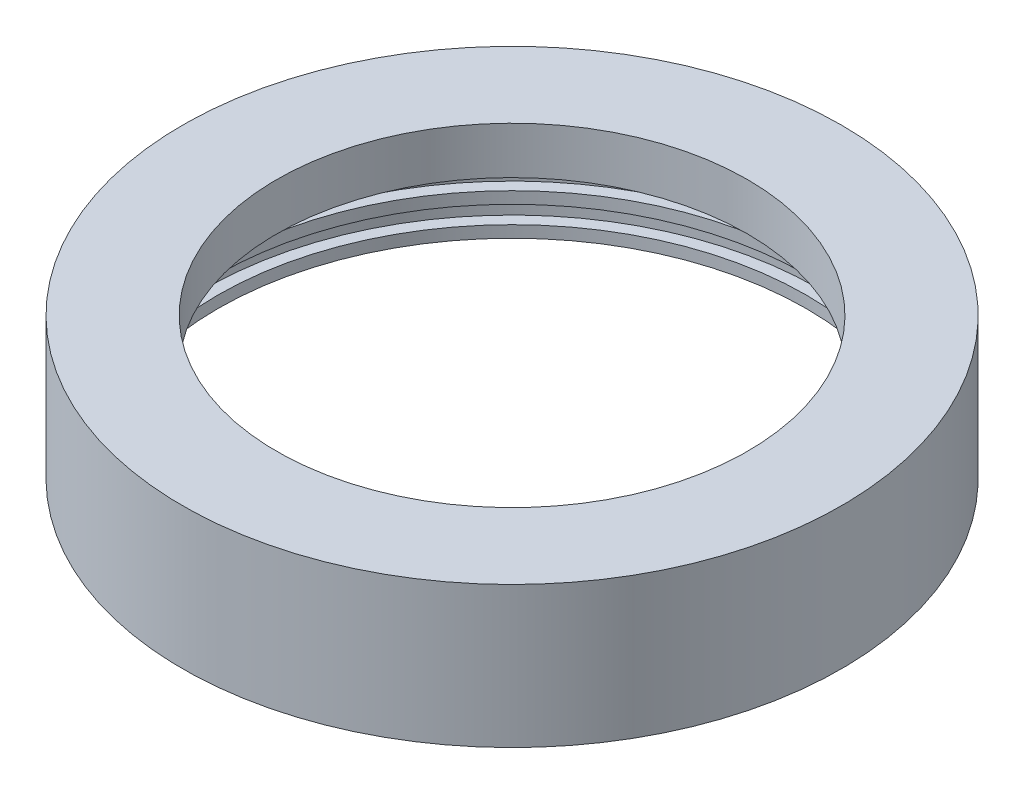
ISO-10303-21;
HEADER;
FILE_DESCRIPTION(('STEP AP214'),'2;1');
FILE_NAME('part.step','',(''),(''),'','','');
FILE_SCHEMA(('AUTOMOTIVE_DESIGN { 1 0 10303 214 1 1 1 1 }'));
ENDSEC;
DATA;
#1=APPLICATION_CONTEXT('core data for automotive mechanical design processes');
#2=APPLICATION_PROTOCOL_DEFINITION('international standard','automotive_design',2000,#1);
#3=PRODUCT_CONTEXT('',#1,'mechanical');
#4=PRODUCT('Part','Part','',(#3));
#5=PRODUCT_RELATED_PRODUCT_CATEGORY('part','',(#4));
#6=PRODUCT_DEFINITION_FORMATION('','',#4);
#7=PRODUCT_DEFINITION_CONTEXT('part definition',#1,'design');
#8=PRODUCT_DEFINITION('design','',#6,#7);
#9=PRODUCT_DEFINITION_SHAPE('','',#8);
#10=(LENGTH_UNIT() NAMED_UNIT(*) SI_UNIT(.MILLI.,.METRE.));
#11=(NAMED_UNIT(*) PLANE_ANGLE_UNIT() SI_UNIT($,.RADIAN.));
#12=(NAMED_UNIT(*) SI_UNIT($,.STERADIAN.) SOLID_ANGLE_UNIT());
#13=UNCERTAINTY_MEASURE_WITH_UNIT(LENGTH_MEASURE(1.E-05),#10,'distance_accuracy_value','');
#14=(GEOMETRIC_REPRESENTATION_CONTEXT(3) GLOBAL_UNCERTAINTY_ASSIGNED_CONTEXT((#13)) GLOBAL_UNIT_ASSIGNED_CONTEXT((#10,
#11,#12)) REPRESENTATION_CONTEXT('',''));
#15=CARTESIAN_POINT('',(0.,0.,0.));
#16=DIRECTION('',(0.,0.,1.));
#17=DIRECTION('',(1.,0.,0.));
#18=AXIS2_PLACEMENT_3D('',#15,#16,#17);
#19=CARTESIAN_POINT('',(0.,38.1,0.));
#20=DIRECTION('',(0.,-1.,0.));
#21=DIRECTION('',(0.,0.,-1.));
#22=AXIS2_PLACEMENT_3D('',#19,#20,#21);
#23=PLANE('',#22);
#24=CARTESIAN_POINT('',(0.,38.1,0.));
#25=DIRECTION('',(0.,-1.,0.));
#26=DIRECTION('',(0.,0.,-1.));
#27=AXIS2_PLACEMENT_3D('',#24,#25,#26);
#28=CIRCLE('',#27,88.9);
#29=CARTESIAN_POINT('',(0.,38.1,-88.9));
#30=VERTEX_POINT('',#29);
#31=EDGE_CURVE('E81',#30,#30,#28,.T.);
#32=ORIENTED_EDGE('',*,*,#31,.F.);
#33=EDGE_LOOP('',(#32));
#34=FACE_BOUND('',#33,.T.);
#35=CARTESIAN_POINT('',(0.,38.1,0.));
#36=DIRECTION('',(0.,-1.,0.));
#37=DIRECTION('',(0.,0.,-1.));
#38=AXIS2_PLACEMENT_3D('',#35,#36,#37);
#39=CIRCLE('',#38,63.5);
#40=CARTESIAN_POINT('',(0.,38.1,-63.5));
#41=VERTEX_POINT('',#40);
#42=EDGE_CURVE('E10',#41,#41,#39,.T.);
#43=ORIENTED_EDGE('',*,*,#42,.T.);
#44=EDGE_LOOP('',(#43));
#45=FACE_BOUND('',#44,.T.);
#46=ADVANCED_FACE('F35',(#34,#45),#23,.F.);
#47=CARTESIAN_POINT('',(0.,0.,0.));
#48=DIRECTION('',(0.,-1.,0.));
#49=DIRECTION('',(0.,0.,-1.));
#50=AXIS2_PLACEMENT_3D('',#47,#48,#49);
#51=CYLINDRICAL_SURFACE('',#50,63.5);
#52=ORIENTED_EDGE('',*,*,#42,.F.);
#53=EDGE_LOOP('',(#52));
#54=FACE_BOUND('',#53,.T.);
#55=CARTESIAN_POINT('',(0.,25.4,0.));
#56=DIRECTION('',(0.,-1.,0.));
#57=DIRECTION('',(0.,0.,-1.));
#58=AXIS2_PLACEMENT_3D('',#55,#56,#57);
#59=CIRCLE('',#58,63.5);
#60=CARTESIAN_POINT('',(0.,25.4,-63.5));
#61=VERTEX_POINT('',#60);
#62=EDGE_CURVE('E41',#61,#61,#59,.T.);
#63=ORIENTED_EDGE('',*,*,#62,.T.);
#64=EDGE_LOOP('',(#63));
#65=FACE_BOUND('',#64,.T.);
#66=ADVANCED_FACE('F89',(#54,#65),#51,.F.);
#67=CARTESIAN_POINT('',(0.,25.4,0.));
#68=DIRECTION('',(0.,-1.,0.));
#69=DIRECTION('',(0.,0.,-1.));
#70=AXIS2_PLACEMENT_3D('',#67,#68,#69);
#71=PLANE('',#70);
#72=CARTESIAN_POINT('',(0.,25.4,0.));
#73=DIRECTION('',(0.,-1.,0.));
#74=DIRECTION('',(0.,0.,-1.));
#75=AXIS2_PLACEMENT_3D('',#72,#73,#74);
#76=CIRCLE('',#75,79.375);
#77=CARTESIAN_POINT('',(0.,25.4,-79.375));
#78=VERTEX_POINT('',#77);
#79=EDGE_CURVE('E45',#78,#78,#76,.T.);
#80=ORIENTED_EDGE('',*,*,#79,.T.);
#81=EDGE_LOOP('',(#80));
#82=FACE_BOUND('',#81,.T.);
#83=ORIENTED_EDGE('',*,*,#62,.F.);
#84=EDGE_LOOP('',(#83));
#85=FACE_BOUND('',#84,.T.);
#86=ADVANCED_FACE('F93',(#82,#85),#71,.T.);
#87=CARTESIAN_POINT('',(0.,0.,0.));
#88=DIRECTION('',(0.,-1.,0.));
#89=DIRECTION('',(0.,0.,-1.));
#90=AXIS2_PLACEMENT_3D('',#87,#88,#89);
#91=CYLINDRICAL_SURFACE('',#90,79.375);
#92=CARTESIAN_POINT('',(0.,15.875,0.));
#93=DIRECTION('',(0.,-1.,0.));
#94=DIRECTION('',(0.,0.,-1.));
#95=AXIS2_PLACEMENT_3D('',#92,#93,#94);
#96=CIRCLE('',#95,79.375);
#97=CARTESIAN_POINT('',(0.,15.875,-79.375));
#98=VERTEX_POINT('',#97);
#99=EDGE_CURVE('E49',#98,#98,#96,.T.);
#100=ORIENTED_EDGE('',*,*,#99,.T.);
#101=EDGE_LOOP('',(#100));
#102=FACE_BOUND('',#101,.T.);
#103=ORIENTED_EDGE('',*,*,#79,.F.);
#104=EDGE_LOOP('',(#103));
#105=FACE_BOUND('',#104,.T.);
#106=ADVANCED_FACE('F98',(#102,#105),#91,.F.);
#107=CARTESIAN_POINT('',(0.,15.875,0.));
#108=DIRECTION('',(0.,-1.,0.));
#109=DIRECTION('',(0.,0.,-1.));
#110=AXIS2_PLACEMENT_3D('',#107,#108,#109);
#111=PLANE('',#110);
#112=CARTESIAN_POINT('',(0.,15.875,0.));
#113=DIRECTION('',(0.,-1.,0.));
#114=DIRECTION('',(0.,0.,-1.));
#115=AXIS2_PLACEMENT_3D('',#112,#113,#114);
#116=CIRCLE('',#115,82.55);
#117=CARTESIAN_POINT('',(0.,15.875,-82.55));
#118=VERTEX_POINT('',#117);
#119=EDGE_CURVE('E54',#118,#118,#116,.T.);
#120=ORIENTED_EDGE('',*,*,#119,.T.);
#121=EDGE_LOOP('',(#120));
#122=FACE_BOUND('',#121,.T.);
#123=ORIENTED_EDGE('',*,*,#99,.F.);
#124=EDGE_LOOP('',(#123));
#125=FACE_BOUND('',#124,.T.);
#126=ADVANCED_FACE('F104',(#122,#125),#111,.T.);
#127=CARTESIAN_POINT('',(0.,0.,0.));
#128=DIRECTION('',(0.,-1.,0.));
#129=DIRECTION('',(0.,0.,-1.));
#130=AXIS2_PLACEMENT_3D('',#127,#128,#129);
#131=CYLINDRICAL_SURFACE('',#130,82.55);
#132=CARTESIAN_POINT('',(0.,11.1125,0.));
#133=DIRECTION('',(0.,-1.,0.));
#134=DIRECTION('',(0.,0.,-1.));
#135=AXIS2_PLACEMENT_3D('',#132,#133,#134);
#136=CIRCLE('',#135,82.55);
#137=CARTESIAN_POINT('',(0.,11.1125,-82.55));
#138=VERTEX_POINT('',#137);
#139=EDGE_CURVE('E57',#138,#138,#136,.T.);
#140=ORIENTED_EDGE('',*,*,#139,.T.);
#141=EDGE_LOOP('',(#140));
#142=FACE_BOUND('',#141,.T.);
#143=ORIENTED_EDGE('',*,*,#119,.F.);
#144=EDGE_LOOP('',(#143));
#145=FACE_BOUND('',#144,.T.);
#146=ADVANCED_FACE('F108',(#142,#145),#131,.F.);
#147=CARTESIAN_POINT('',(0.,11.1125,0.));
#148=DIRECTION('',(0.,1.,0.));
#149=DIRECTION('',(0.,0.,1.));
#150=AXIS2_PLACEMENT_3D('',#147,#148,#149);
#151=PLANE('',#150);
#152=CARTESIAN_POINT('',(0.,11.1125,0.));
#153=DIRECTION('',(0.,-1.,0.));
#154=DIRECTION('',(0.,0.,-1.));
#155=AXIS2_PLACEMENT_3D('',#152,#153,#154);
#156=CIRCLE('',#155,79.375);
#157=CARTESIAN_POINT('',(0.,11.1125,-79.375));
#158=VERTEX_POINT('',#157);
#159=EDGE_CURVE('E60',#158,#158,#156,.T.);
#160=ORIENTED_EDGE('',*,*,#159,.T.);
#161=EDGE_LOOP('',(#160));
#162=FACE_BOUND('',#161,.T.);
#163=ORIENTED_EDGE('',*,*,#139,.F.);
#164=EDGE_LOOP('',(#163));
#165=FACE_BOUND('',#164,.T.);
#166=ADVANCED_FACE('F112',(#162,#165),#151,.T.);
#167=CARTESIAN_POINT('',(0.,0.,0.));
#168=DIRECTION('',(0.,-1.,0.));
#169=DIRECTION('',(0.,0.,-1.));
#170=AXIS2_PLACEMENT_3D('',#167,#168,#169);
#171=CYLINDRICAL_SURFACE('',#170,79.375);
#172=CARTESIAN_POINT('',(0.,7.9375,0.));
#173=DIRECTION('',(0.,-1.,0.));
#174=DIRECTION('',(0.,0.,-1.));
#175=AXIS2_PLACEMENT_3D('',#172,#173,#174);
#176=CIRCLE('',#175,79.375);
#177=CARTESIAN_POINT('',(0.,7.9375,-79.375));
#178=VERTEX_POINT('',#177);
#179=EDGE_CURVE('E63',#178,#178,#176,.T.);
#180=ORIENTED_EDGE('',*,*,#179,.T.);
#181=EDGE_LOOP('',(#180));
#182=FACE_BOUND('',#181,.T.);
#183=ORIENTED_EDGE('',*,*,#159,.F.);
#184=EDGE_LOOP('',(#183));
#185=FACE_BOUND('',#184,.T.);
#186=ADVANCED_FACE('F116',(#182,#185),#171,.F.);
#187=CARTESIAN_POINT('',(0.,7.9375,0.));
#188=DIRECTION('',(0.,-1.,0.));
#189=DIRECTION('',(0.,0.,-1.));
#190=AXIS2_PLACEMENT_3D('',#187,#188,#189);
#191=PLANE('',#190);
#192=CARTESIAN_POINT('',(0.,7.9375,0.));
#193=DIRECTION('',(0.,-1.,0.));
#194=DIRECTION('',(0.,0.,-1.));
#195=AXIS2_PLACEMENT_3D('',#192,#193,#194);
#196=CIRCLE('',#195,82.55);
#197=CARTESIAN_POINT('',(0.,7.9375,-82.55));
#198=VERTEX_POINT('',#197);
#199=EDGE_CURVE('E66',#198,#198,#196,.T.);
#200=ORIENTED_EDGE('',*,*,#199,.T.);
#201=EDGE_LOOP('',(#200));
#202=FACE_BOUND('',#201,.T.);
#203=ORIENTED_EDGE('',*,*,#179,.F.);
#204=EDGE_LOOP('',(#203));
#205=FACE_BOUND('',#204,.T.);
#206=ADVANCED_FACE('F120',(#202,#205),#191,.T.);
#207=CARTESIAN_POINT('',(0.,0.,0.));
#208=DIRECTION('',(0.,-1.,0.));
#209=DIRECTION('',(0.,0.,-1.));
#210=AXIS2_PLACEMENT_3D('',#207,#208,#209);
#211=CYLINDRICAL_SURFACE('',#210,82.55);
#212=CARTESIAN_POINT('',(0.,3.17500000000001,0.));
#213=DIRECTION('',(0.,-1.,0.));
#214=DIRECTION('',(0.,0.,-1.));
#215=AXIS2_PLACEMENT_3D('',#212,#213,#214);
#216=CIRCLE('',#215,82.55);
#217=CARTESIAN_POINT('',(0.,3.17500000000001,-82.55));
#218=VERTEX_POINT('',#217);
#219=EDGE_CURVE('E69',#218,#218,#216,.T.);
#220=ORIENTED_EDGE('',*,*,#219,.T.);
#221=EDGE_LOOP('',(#220));
#222=FACE_BOUND('',#221,.T.);
#223=ORIENTED_EDGE('',*,*,#199,.F.);
#224=EDGE_LOOP('',(#223));
#225=FACE_BOUND('',#224,.T.);
#226=ADVANCED_FACE('F124',(#222,#225),#211,.F.);
#227=CARTESIAN_POINT('',(0.,3.175,0.));
#228=DIRECTION('',(0.,1.,0.));
#229=DIRECTION('',(0.,0.,1.));
#230=AXIS2_PLACEMENT_3D('',#227,#228,#229);
#231=PLANE('',#230);
#232=CARTESIAN_POINT('',(0.,3.175,0.));
#233=DIRECTION('',(0.,-1.,0.));
#234=DIRECTION('',(0.,0.,-1.));
#235=AXIS2_PLACEMENT_3D('',#232,#233,#234);
#236=CIRCLE('',#235,79.375);
#237=CARTESIAN_POINT('',(0.,3.175,-79.375));
#238=VERTEX_POINT('',#237);
#239=EDGE_CURVE('E72',#238,#238,#236,.T.);
#240=ORIENTED_EDGE('',*,*,#239,.T.);
#241=EDGE_LOOP('',(#240));
#242=FACE_BOUND('',#241,.T.);
#243=ORIENTED_EDGE('',*,*,#219,.F.);
#244=EDGE_LOOP('',(#243));
#245=FACE_BOUND('',#244,.T.);
#246=ADVANCED_FACE('F128',(#242,#245),#231,.T.);
#247=CARTESIAN_POINT('',(0.,0.,0.));
#248=DIRECTION('',(0.,-1.,0.));
#249=DIRECTION('',(0.,0.,-1.));
#250=AXIS2_PLACEMENT_3D('',#247,#248,#249);
#251=CYLINDRICAL_SURFACE('',#250,79.375);
#252=CARTESIAN_POINT('',(0.,0.,0.));
#253=DIRECTION('',(0.,-1.,0.));
#254=DIRECTION('',(0.,0.,-1.));
#255=AXIS2_PLACEMENT_3D('',#252,#253,#254);
#256=CIRCLE('',#255,79.375);
#257=CARTESIAN_POINT('',(0.,0.,-79.375));
#258=VERTEX_POINT('',#257);
#259=EDGE_CURVE('E75',#258,#258,#256,.T.);
#260=ORIENTED_EDGE('',*,*,#259,.T.);
#261=EDGE_LOOP('',(#260));
#262=FACE_BOUND('',#261,.T.);
#263=ORIENTED_EDGE('',*,*,#239,.F.);
#264=EDGE_LOOP('',(#263));
#265=FACE_BOUND('',#264,.T.);
#266=ADVANCED_FACE('F132',(#262,#265),#251,.F.);
#267=CARTESIAN_POINT('',(0.,0.,0.));
#268=DIRECTION('',(0.,-1.,0.));
#269=DIRECTION('',(0.,0.,-1.));
#270=AXIS2_PLACEMENT_3D('',#267,#268,#269);
#271=PLANE('',#270);
#272=CARTESIAN_POINT('',(0.,0.,0.));
#273=DIRECTION('',(0.,-1.,0.));
#274=DIRECTION('',(0.,0.,-1.));
#275=AXIS2_PLACEMENT_3D('',#272,#273,#274);
#276=CIRCLE('',#275,88.9);
#277=CARTESIAN_POINT('',(0.,0.,-88.9));
#278=VERTEX_POINT('',#277);
#279=EDGE_CURVE('E78',#278,#278,#276,.T.);
#280=ORIENTED_EDGE('',*,*,#279,.T.);
#281=EDGE_LOOP('',(#280));
#282=FACE_BOUND('',#281,.T.);
#283=ORIENTED_EDGE('',*,*,#259,.F.);
#284=EDGE_LOOP('',(#283));
#285=FACE_BOUND('',#284,.T.);
#286=ADVANCED_FACE('F136',(#282,#285),#271,.T.);
#287=CARTESIAN_POINT('',(0.,0.,0.));
#288=DIRECTION('',(0.,-1.,0.));
#289=DIRECTION('',(0.,0.,-1.));
#290=AXIS2_PLACEMENT_3D('',#287,#288,#289);
#291=CYLINDRICAL_SURFACE('',#290,88.9);
#292=ORIENTED_EDGE('',*,*,#31,.T.);
#293=EDGE_LOOP('',(#292));
#294=FACE_BOUND('',#293,.T.);
#295=ORIENTED_EDGE('',*,*,#279,.F.);
#296=EDGE_LOOP('',(#295));
#297=FACE_BOUND('',#296,.T.);
#298=ADVANCED_FACE('F85',(#294,#297),#291,.T.);
#299=CLOSED_SHELL('',(#46,#66,#86,#106,#126,#146,#166,#186,#206,#226,#246,#266,#286,#298));
#300=MANIFOLD_SOLID_BREP('B2',#299);
#301=ADVANCED_BREP_SHAPE_REPRESENTATION('',(#18,#300),#14);
#302=SHAPE_DEFINITION_REPRESENTATION(#9,#301);
ENDSEC;
END-ISO-10303-21;
